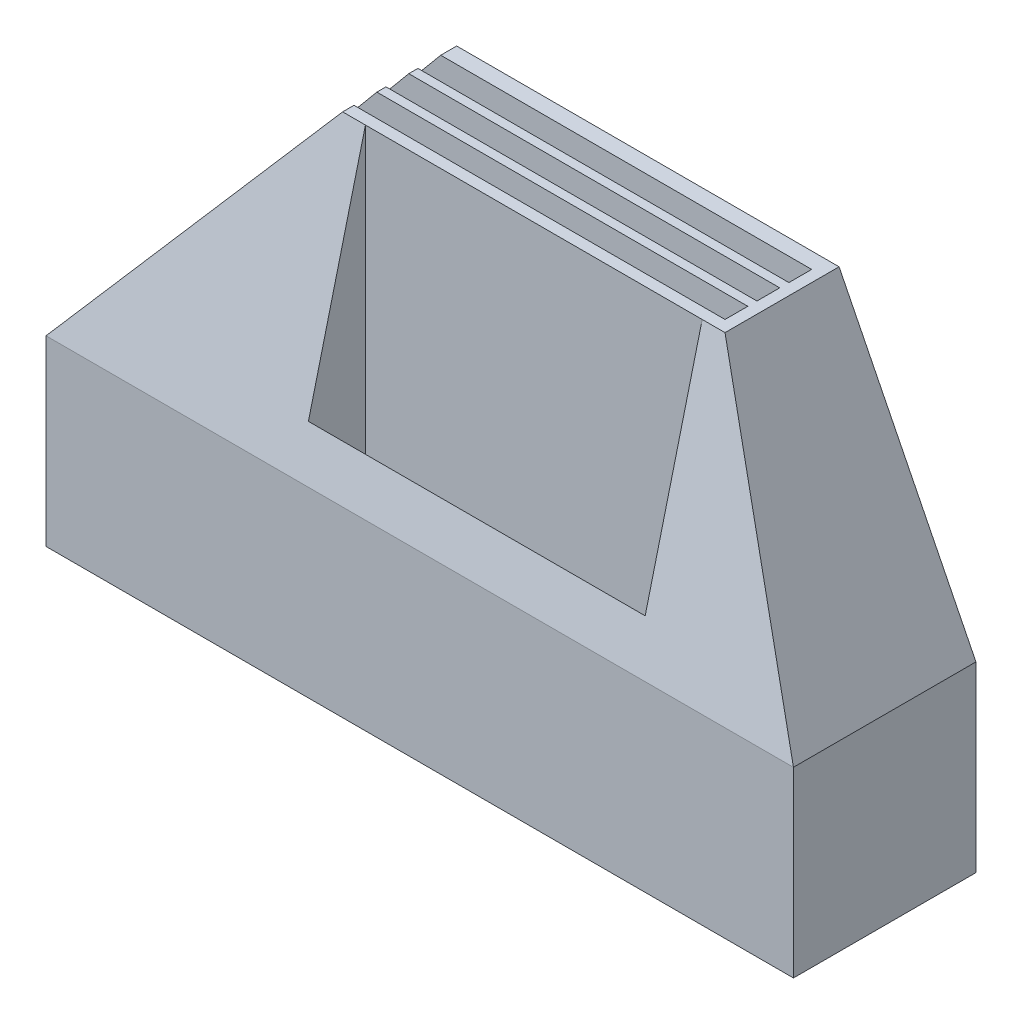
ISO-10303-21;
HEADER;
FILE_DESCRIPTION(('STEP AP214'),'2;1');
FILE_NAME('part.step','',(''),(''),'','','');
FILE_SCHEMA(('AUTOMOTIVE_DESIGN { 1 0 10303 214 1 1 1 1 }'));
ENDSEC;
DATA;
#1=APPLICATION_CONTEXT('core data for automotive mechanical design processes');
#2=APPLICATION_PROTOCOL_DEFINITION('international standard','automotive_design',2000,#1);
#3=PRODUCT_CONTEXT('',#1,'mechanical');
#4=PRODUCT('Part','Part','',(#3));
#5=PRODUCT_RELATED_PRODUCT_CATEGORY('part','',(#4));
#6=PRODUCT_DEFINITION_FORMATION('','',#4);
#7=PRODUCT_DEFINITION_CONTEXT('part definition',#1,'design');
#8=PRODUCT_DEFINITION('design','',#6,#7);
#9=PRODUCT_DEFINITION_SHAPE('','',#8);
#10=(LENGTH_UNIT() NAMED_UNIT(*) SI_UNIT(.MILLI.,.METRE.));
#11=(NAMED_UNIT(*) PLANE_ANGLE_UNIT() SI_UNIT($,.RADIAN.));
#12=(NAMED_UNIT(*) SI_UNIT($,.STERADIAN.) SOLID_ANGLE_UNIT());
#13=UNCERTAINTY_MEASURE_WITH_UNIT(LENGTH_MEASURE(1.E-05),#10,'distance_accuracy_value','');
#14=(GEOMETRIC_REPRESENTATION_CONTEXT(3) GLOBAL_UNCERTAINTY_ASSIGNED_CONTEXT((#13)) GLOBAL_UNIT_ASSIGNED_CONTEXT((#10,
#11,#12)) REPRESENTATION_CONTEXT('',''));
#15=CARTESIAN_POINT('',(0.,0.,0.));
#16=DIRECTION('',(0.,0.,1.));
#17=DIRECTION('',(1.,0.,0.));
#18=AXIS2_PLACEMENT_3D('',#15,#16,#17);
#19=CARTESIAN_POINT('',(0.,254.,0.));
#20=DIRECTION('',(0.,-1.,0.));
#21=DIRECTION('',(0.,0.,-1.));
#22=AXIS2_PLACEMENT_3D('',#19,#20,#21);
#23=PLANE('',#22);
#24=DIRECTION('',(0.,0.,1.));
#25=VECTOR('',#24,1.);
#26=CARTESIAN_POINT('',(127.,254.,-101.6));
#27=LINE('',#26,#25);
#28=CARTESIAN_POINT('',(127.,254.,-44.45));
#29=VERTEX_POINT('',#28);
#30=CARTESIAN_POINT('',(127.,254.,-38.1));
#31=VERTEX_POINT('',#30);
#32=EDGE_CURVE('E399',#29,#31,#27,.T.);
#33=ORIENTED_EDGE('',*,*,#32,.T.);
#34=DIRECTION('',(1.,0.,0.));
#35=VECTOR('',#34,1.);
#36=CARTESIAN_POINT('',(-1.11022302462516E-13,254.,-38.1));
#37=LINE('',#36,#35);
#38=CARTESIAN_POINT('',(139.7,254.,-38.1));
#39=VERTEX_POINT('',#38);
#40=EDGE_CURVE('E271',#31,#39,#37,.T.);
#41=ORIENTED_EDGE('',*,*,#40,.T.);
#42=DIRECTION('',(-1.,0.,0.));
#43=VECTOR('',#42,1.);
#44=CARTESIAN_POINT('',(139.7,254.,-38.1));
#45=LINE('',#44,#43);
#46=CARTESIAN_POINT('',(327.18,254.,-38.1));
#47=VERTEX_POINT('',#46);
#48=EDGE_CURVE('E372',#47,#39,#45,.T.);
#49=ORIENTED_EDGE('',*,*,#48,.F.);
#50=CARTESIAN_POINT('',(339.88,254.,-38.1));
#51=VERTEX_POINT('',#50);
#52=EDGE_CURVE('E268',#47,#51,#37,.T.);
#53=ORIENTED_EDGE('',*,*,#52,.T.);
#54=DIRECTION('',(0.,0.,1.));
#55=VECTOR('',#54,1.);
#56=CARTESIAN_POINT('',(339.88,254.,-101.6));
#57=LINE('',#56,#55);
#58=CARTESIAN_POINT('',(339.88,254.,-101.6));
#59=VERTEX_POINT('',#58);
#60=EDGE_CURVE('E409',#59,#51,#57,.T.);
#61=ORIENTED_EDGE('',*,*,#60,.F.);
#62=DIRECTION('',(-1.,0.,0.));
#63=VECTOR('',#62,1.);
#64=CARTESIAN_POINT('',(-1.38777878078145E-13,254.,-101.6));
#65=LINE('',#64,#63);
#66=CARTESIAN_POINT('',(127.,254.,-101.6));
#67=VERTEX_POINT('',#66);
#68=EDGE_CURVE('E416',#59,#67,#65,.T.);
#69=ORIENTED_EDGE('',*,*,#68,.T.);
#70=CARTESIAN_POINT('',(127.,254.,-92.71));
#71=VERTEX_POINT('',#70);
#72=EDGE_CURVE('E405',#67,#71,#27,.T.);
#73=ORIENTED_EDGE('',*,*,#72,.T.);
#74=DIRECTION('',(-1.,0.,0.));
#75=VECTOR('',#74,1.);
#76=CARTESIAN_POINT('',(6.34999999999974,254.,-92.71));
#77=LINE('',#76,#75);
#78=CARTESIAN_POINT('',(333.53,254.,-92.71));
#79=VERTEX_POINT('',#78);
#80=EDGE_CURVE('E327',#79,#71,#77,.T.);
#81=ORIENTED_EDGE('',*,*,#80,.F.);
#82=DIRECTION('',(0.,0.,-1.));
#83=VECTOR('',#82,1.);
#84=CARTESIAN_POINT('',(333.53,254.,-80.01));
#85=LINE('',#84,#83);
#86=CARTESIAN_POINT('',(333.53,254.,-80.01));
#87=VERTEX_POINT('',#86);
#88=EDGE_CURVE('E355',#87,#79,#85,.T.);
#89=ORIENTED_EDGE('',*,*,#88,.F.);
#90=DIRECTION('',(1.,0.,0.));
#91=VECTOR('',#90,1.);
#92=CARTESIAN_POINT('',(6.34999999999974,254.,-80.01));
#93=LINE('',#92,#91);
#94=CARTESIAN_POINT('',(127.,254.,-80.01));
#95=VERTEX_POINT('',#94);
#96=EDGE_CURVE('E358',#95,#87,#93,.T.);
#97=ORIENTED_EDGE('',*,*,#96,.F.);
#98=CARTESIAN_POINT('',(127.,254.,-74.93));
#99=VERTEX_POINT('',#98);
#100=EDGE_CURVE('E408',#95,#99,#27,.T.);
#101=ORIENTED_EDGE('',*,*,#100,.T.);
#102=DIRECTION('',(-1.,0.,0.));
#103=VECTOR('',#102,1.);
#104=CARTESIAN_POINT('',(6.3499999999998,254.,-74.93));
#105=LINE('',#104,#103);
#106=CARTESIAN_POINT('',(333.53,254.,-74.93));
#107=VERTEX_POINT('',#106);
#108=EDGE_CURVE('E302',#107,#99,#105,.T.);
#109=ORIENTED_EDGE('',*,*,#108,.F.);
#110=DIRECTION('',(0.,0.,-1.));
#111=VECTOR('',#110,1.);
#112=CARTESIAN_POINT('',(333.53,254.,-62.23));
#113=LINE('',#112,#111);
#114=CARTESIAN_POINT('',(333.53,254.,-62.23));
#115=VERTEX_POINT('',#114);
#116=EDGE_CURVE('E328',#115,#107,#113,.T.);
#117=ORIENTED_EDGE('',*,*,#116,.F.);
#118=DIRECTION('',(1.,0.,0.));
#119=VECTOR('',#118,1.);
#120=CARTESIAN_POINT('',(6.3499999999998,254.,-62.23));
#121=LINE('',#120,#119);
#122=CARTESIAN_POINT('',(127.,254.,-62.23));
#123=VERTEX_POINT('',#122);
#124=EDGE_CURVE('E331',#123,#115,#121,.T.);
#125=ORIENTED_EDGE('',*,*,#124,.F.);
#126=CARTESIAN_POINT('',(127.,254.,-57.15));
#127=VERTEX_POINT('',#126);
#128=EDGE_CURVE('E487',#123,#127,#27,.T.);
#129=ORIENTED_EDGE('',*,*,#128,.T.);
#130=DIRECTION('',(-1.,0.,0.));
#131=VECTOR('',#130,1.);
#132=CARTESIAN_POINT('',(6.34999999999986,254.,-57.15));
#133=LINE('',#132,#131);
#134=CARTESIAN_POINT('',(333.53,254.,-57.15));
#135=VERTEX_POINT('',#134);
#136=EDGE_CURVE('E301',#135,#127,#133,.T.);
#137=ORIENTED_EDGE('',*,*,#136,.F.);
#138=DIRECTION('',(0.,0.,-1.));
#139=VECTOR('',#138,1.);
#140=CARTESIAN_POINT('',(333.53,254.,-44.45));
#141=LINE('',#140,#139);
#142=CARTESIAN_POINT('',(333.53,254.,-44.45));
#143=VERTEX_POINT('',#142);
#144=EDGE_CURVE('E298',#143,#135,#141,.T.);
#145=ORIENTED_EDGE('',*,*,#144,.F.);
#146=DIRECTION('',(1.,0.,0.));
#147=VECTOR('',#146,1.);
#148=CARTESIAN_POINT('',(6.34999999999986,254.,-44.45));
#149=LINE('',#148,#147);
#150=EDGE_CURVE('E288',#29,#143,#149,.T.);
#151=ORIENTED_EDGE('',*,*,#150,.F.);
#152=EDGE_LOOP('',(#33,#41,#49,#53,#61,#69,#73,#81,#89,#97,#101,#109,#117,#125,#129,#137,#145,#151));
#153=FACE_BOUND('',#152,.T.);
#154=ADVANCED_FACE('F41',(#153),#23,.F.);
#155=CARTESIAN_POINT('',(0.,254.,0.));
#156=DIRECTION('',(1.,0.,0.));
#157=DIRECTION('',(0.,0.,-1.));
#158=AXIS2_PLACEMENT_3D('',#155,#156,#157);
#159=PLANE('',#158);
#160=DIRECTION('',(0.,-1.,0.));
#161=VECTOR('',#160,1.);
#162=CARTESIAN_POINT('',(0.,254.,0.));
#163=LINE('',#162,#161);
#164=CARTESIAN_POINT('',(-1.11022302462516E-13,101.6,0.));
#165=VERTEX_POINT('',#164);
#166=CARTESIAN_POINT('',(0.,0.,0.));
#167=VERTEX_POINT('',#166);
#168=EDGE_CURVE('E436',#165,#167,#163,.T.);
#169=ORIENTED_EDGE('',*,*,#168,.F.);
#170=DIRECTION('',(0.,0.,1.));
#171=VECTOR('',#170,1.);
#172=CARTESIAN_POINT('',(0.,101.6,-101.6));
#173=LINE('',#172,#171);
#174=CARTESIAN_POINT('',(0.,101.6,-101.6));
#175=VERTEX_POINT('',#174);
#176=EDGE_CURVE('E401',#175,#165,#173,.T.);
#177=ORIENTED_EDGE('',*,*,#176,.F.);
#178=DIRECTION('',(0.,-1.,0.));
#179=VECTOR('',#178,1.);
#180=CARTESIAN_POINT('',(-1.38777878078145E-13,254.,-101.6));
#181=LINE('',#180,#179);
#182=CARTESIAN_POINT('',(-1.38777878078145E-13,0.,-101.6));
#183=VERTEX_POINT('',#182);
#184=EDGE_CURVE('E419',#175,#183,#181,.T.);
#185=ORIENTED_EDGE('',*,*,#184,.T.);
#186=DIRECTION('',(0.,0.,1.));
#187=VECTOR('',#186,1.);
#188=CARTESIAN_POINT('',(0.,0.,0.));
#189=LINE('',#188,#187);
#190=EDGE_CURVE('E404',#183,#167,#189,.T.);
#191=ORIENTED_EDGE('',*,*,#190,.T.);
#192=EDGE_LOOP('',(#169,#177,#185,#191));
#193=FACE_BOUND('',#192,.T.);
#194=ADVANCED_FACE('F43',(#193),#159,.F.);
#195=CARTESIAN_POINT('',(0.,254.,0.));
#196=DIRECTION('',(0.,0.,-1.));
#197=DIRECTION('',(-1.,0.,0.));
#198=AXIS2_PLACEMENT_3D('',#195,#196,#197);
#199=PLANE('',#198);
#200=DIRECTION('',(0.,-1.,0.));
#201=VECTOR('',#200,1.);
#202=CARTESIAN_POINT('',(416.08,254.,1.66533453693773E-13));
#203=LINE('',#202,#201);
#204=CARTESIAN_POINT('',(416.08,101.6,0.));
#205=VERTEX_POINT('',#204);
#206=CARTESIAN_POINT('',(416.08,0.,1.66533453693773E-13));
#207=VERTEX_POINT('',#206);
#208=EDGE_CURVE('E434',#205,#207,#203,.T.);
#209=ORIENTED_EDGE('',*,*,#208,.F.);
#210=DIRECTION('',(1.,0.,0.));
#211=VECTOR('',#210,1.);
#212=CARTESIAN_POINT('',(-1.11022302462516E-13,101.6,0.));
#213=LINE('',#212,#211);
#214=EDGE_CURVE('E245',#165,#205,#213,.T.);
#215=ORIENTED_EDGE('',*,*,#214,.F.);
#216=ORIENTED_EDGE('',*,*,#168,.T.);
#217=DIRECTION('',(1.,0.,0.));
#218=VECTOR('',#217,1.);
#219=CARTESIAN_POINT('',(0.,0.,0.));
#220=LINE('',#219,#218);
#221=EDGE_CURVE('E423',#167,#207,#220,.T.);
#222=ORIENTED_EDGE('',*,*,#221,.T.);
#223=EDGE_LOOP('',(#209,#215,#216,#222));
#224=FACE_BOUND('',#223,.T.);
#225=ADVANCED_FACE('F525',(#224),#199,.F.);
#226=CARTESIAN_POINT('',(416.08,254.,1.66533453693773E-13));
#227=DIRECTION('',(-1.,0.,0.));
#228=DIRECTION('',(0.,0.,1.));
#229=AXIS2_PLACEMENT_3D('',#226,#227,#228);
#230=PLANE('',#229);
#231=DIRECTION('',(0.,-1.,0.));
#232=VECTOR('',#231,1.);
#233=CARTESIAN_POINT('',(416.08,254.,-101.6));
#234=LINE('',#233,#232);
#235=CARTESIAN_POINT('',(416.08,101.6,-101.6));
#236=VERTEX_POINT('',#235);
#237=CARTESIAN_POINT('',(416.08,0.,-101.6));
#238=VERTEX_POINT('',#237);
#239=EDGE_CURVE('E432',#236,#238,#234,.T.);
#240=ORIENTED_EDGE('',*,*,#239,.F.);
#241=DIRECTION('',(0.,0.,1.));
#242=VECTOR('',#241,1.);
#243=CARTESIAN_POINT('',(416.08,101.6,-101.6));
#244=LINE('',#243,#242);
#245=EDGE_CURVE('E395',#236,#205,#244,.T.);
#246=ORIENTED_EDGE('',*,*,#245,.T.);
#247=ORIENTED_EDGE('',*,*,#208,.T.);
#248=DIRECTION('',(0.,0.,-1.));
#249=VECTOR('',#248,1.);
#250=CARTESIAN_POINT('',(416.08,0.,1.66533453693773E-13));
#251=LINE('',#250,#249);
#252=EDGE_CURVE('E426',#207,#238,#251,.T.);
#253=ORIENTED_EDGE('',*,*,#252,.T.);
#254=EDGE_LOOP('',(#240,#246,#247,#253));
#255=FACE_BOUND('',#254,.T.);
#256=ADVANCED_FACE('F537',(#255),#230,.F.);
#257=CARTESIAN_POINT('',(-1.38777878078145E-13,254.,-101.6));
#258=DIRECTION('',(0.,0.,1.));
#259=DIRECTION('',(1.,0.,0.));
#260=AXIS2_PLACEMENT_3D('',#257,#258,#259);
#261=PLANE('',#260);
#262=DIRECTION('',(-1.,0.,0.));
#263=VECTOR('',#262,1.);
#264=CARTESIAN_POINT('',(314.48,10.4540584538938,-101.6));
#265=LINE('',#264,#263);
#266=CARTESIAN_POINT('',(314.48,10.4540584538938,-101.6));
#267=VERTEX_POINT('',#266);
#268=CARTESIAN_POINT('',(152.4,10.4540584538938,-101.6));
#269=VERTEX_POINT('',#268);
#270=EDGE_CURVE('E251',#267,#269,#265,.T.);
#271=ORIENTED_EDGE('',*,*,#270,.F.);
#272=DIRECTION('',(0.,-1.,0.));
#273=VECTOR('',#272,1.);
#274=CARTESIAN_POINT('',(314.48,10.4540584538938,-101.6));
#275=LINE('',#274,#273);
#276=CARTESIAN_POINT('',(314.48,23.6587076548535,-101.6));
#277=VERTEX_POINT('',#276);
#278=EDGE_CURVE('E233',#277,#267,#275,.T.);
#279=ORIENTED_EDGE('',*,*,#278,.F.);
#280=DIRECTION('',(1.,0.,0.));
#281=VECTOR('',#280,1.);
#282=CARTESIAN_POINT('',(314.48,23.6587076548535,-101.6));
#283=LINE('',#282,#281);
#284=CARTESIAN_POINT('',(152.4,23.6587076548535,-101.6));
#285=VERTEX_POINT('',#284);
#286=EDGE_CURVE('E242',#285,#277,#283,.T.);
#287=ORIENTED_EDGE('',*,*,#286,.F.);
#288=DIRECTION('',(0.,1.,0.));
#289=VECTOR('',#288,1.);
#290=CARTESIAN_POINT('',(152.4,10.4540584538938,-101.6));
#291=LINE('',#290,#289);
#292=EDGE_CURVE('E56',#269,#285,#291,.T.);
#293=ORIENTED_EDGE('',*,*,#292,.F.);
#294=EDGE_LOOP('',(#271,#279,#287,#293));
#295=FACE_BOUND('',#294,.T.);
#296=ORIENTED_EDGE('',*,*,#184,.F.);
#297=DIRECTION('',(0.64018439966448,0.768221279597376,0.));
#298=VECTOR('',#297,1.);
#299=CARTESIAN_POINT('',(127.,254.,-101.6));
#300=LINE('',#299,#298);
#301=EDGE_CURVE('E396',#175,#67,#300,.T.);
#302=ORIENTED_EDGE('',*,*,#301,.T.);
#303=ORIENTED_EDGE('',*,*,#68,.F.);
#304=DIRECTION('',(0.447213595499958,-0.894427190999916,0.));
#305=VECTOR('',#304,1.);
#306=CARTESIAN_POINT('',(416.08,101.6,-101.6));
#307=LINE('',#306,#305);
#308=EDGE_CURVE('E400',#59,#236,#307,.T.);
#309=ORIENTED_EDGE('',*,*,#308,.T.);
#310=ORIENTED_EDGE('',*,*,#239,.T.);
#311=DIRECTION('',(-1.,0.,0.));
#312=VECTOR('',#311,1.);
#313=CARTESIAN_POINT('',(-1.38777878078145E-13,0.,-101.6));
#314=LINE('',#313,#312);
#315=EDGE_CURVE('E420',#238,#183,#314,.T.);
#316=ORIENTED_EDGE('',*,*,#315,.T.);
#317=EDGE_LOOP('',(#296,#302,#303,#309,#310,#316));
#318=FACE_BOUND('',#317,.T.);
#319=ADVANCED_FACE('F248',(#295,#318),#261,.F.);
#320=CARTESIAN_POINT('',(0.,0.,0.));
#321=DIRECTION('',(0.,-1.,0.));
#322=DIRECTION('',(0.,0.,-1.));
#323=AXIS2_PLACEMENT_3D('',#320,#321,#322);
#324=PLANE('',#323);
#325=ORIENTED_EDGE('',*,*,#190,.F.);
#326=ORIENTED_EDGE('',*,*,#315,.F.);
#327=ORIENTED_EDGE('',*,*,#252,.F.);
#328=ORIENTED_EDGE('',*,*,#221,.F.);
#329=EDGE_LOOP('',(#325,#326,#327,#328));
#330=FACE_BOUND('',#329,.T.);
#331=ADVANCED_FACE('F531',(#330),#324,.T.);
#332=CARTESIAN_POINT('',(416.08,101.6,-101.6));
#333=DIRECTION('',(-0.894427190999916,-0.447213595499958,0.));
#334=DIRECTION('',(0.447213595499958,-0.894427190999916,0.));
#335=AXIS2_PLACEMENT_3D('',#332,#333,#334);
#336=PLANE('',#335);
#337=ORIENTED_EDGE('',*,*,#60,.T.);
#338=DIRECTION('',(0.436435780471985,-0.872871560943969,0.218217890235992));
#339=VECTOR('',#338,1.);
#340=CARTESIAN_POINT('',(406.40380952381,120.952380952381,-4.83809523809525));
#341=LINE('',#340,#339);
#342=EDGE_CURVE('E280',#51,#205,#341,.T.);
#343=ORIENTED_EDGE('',*,*,#342,.T.);
#344=ORIENTED_EDGE('',*,*,#245,.F.);
#345=ORIENTED_EDGE('',*,*,#308,.F.);
#346=EDGE_LOOP('',(#337,#343,#344,#345));
#347=FACE_BOUND('',#346,.T.);
#348=ADVANCED_FACE('F529',(#347),#336,.F.);
#349=CARTESIAN_POINT('',(127.,254.,-101.6));
#350=DIRECTION('',(0.768221279597376,-0.64018439966448,0.));
#351=DIRECTION('',(0.64018439966448,0.768221279597376,0.));
#352=AXIS2_PLACEMENT_3D('',#349,#350,#351);
#353=PLANE('',#352);
#354=ORIENTED_EDGE('',*,*,#176,.T.);
#355=DIRECTION('',(0.628694613461931,0.754433536154318,-0.188608384038579));
#356=VECTOR('',#355,1.);
#357=CARTESIAN_POINT('',(134.529644268775,263.03557312253,-40.3588932806324));
#358=LINE('',#357,#356);
#359=EDGE_CURVE('E277',#165,#31,#358,.T.);
#360=ORIENTED_EDGE('',*,*,#359,.T.);
#361=ORIENTED_EDGE('',*,*,#32,.F.);
#362=DIRECTION('',(-0.64018439966448,-0.768221279597376,0.));
#363=VECTOR('',#362,1.);
#364=CARTESIAN_POINT('',(127.,254.,-44.45));
#365=LINE('',#364,#363);
#366=CARTESIAN_POINT('',(6.34999999999986,109.22,-44.45));
#367=VERTEX_POINT('',#366);
#368=EDGE_CURVE('E49',#29,#367,#365,.T.);
#369=ORIENTED_EDGE('',*,*,#368,.T.);
#370=DIRECTION('',(0.,0.,-1.));
#371=VECTOR('',#370,1.);
#372=CARTESIAN_POINT('',(6.34999999999986,109.22,-101.6));
#373=LINE('',#372,#371);
#374=CARTESIAN_POINT('',(6.3499999999998,109.22,-57.15));
#375=VERTEX_POINT('',#374);
#376=EDGE_CURVE('E459',#367,#375,#373,.T.);
#377=ORIENTED_EDGE('',*,*,#376,.T.);
#378=DIRECTION('',(0.64018439966448,0.768221279597376,0.));
#379=VECTOR('',#378,1.);
#380=CARTESIAN_POINT('',(127.,254.,-57.15));
#381=LINE('',#380,#379);
#382=EDGE_CURVE('E456',#375,#127,#381,.T.);
#383=ORIENTED_EDGE('',*,*,#382,.T.);
#384=ORIENTED_EDGE('',*,*,#128,.F.);
#385=DIRECTION('',(-0.64018439966448,-0.768221279597376,0.));
#386=VECTOR('',#385,1.);
#387=CARTESIAN_POINT('',(127.,254.,-62.23));
#388=LINE('',#387,#386);
#389=CARTESIAN_POINT('',(6.3499999999998,109.22,-62.23));
#390=VERTEX_POINT('',#389);
#391=EDGE_CURVE('E450',#123,#390,#388,.T.);
#392=ORIENTED_EDGE('',*,*,#391,.T.);
#393=DIRECTION('',(0.,0.,-1.));
#394=VECTOR('',#393,1.);
#395=CARTESIAN_POINT('',(6.3499999999998,109.22,-101.6));
#396=LINE('',#395,#394);
#397=CARTESIAN_POINT('',(6.3499999999998,109.22,-74.93));
#398=VERTEX_POINT('',#397);
#399=EDGE_CURVE('E447',#390,#398,#396,.T.);
#400=ORIENTED_EDGE('',*,*,#399,.T.);
#401=DIRECTION('',(0.64018439966448,0.768221279597376,0.));
#402=VECTOR('',#401,1.);
#403=CARTESIAN_POINT('',(127.,254.,-74.93));
#404=LINE('',#403,#402);
#405=EDGE_CURVE('E453',#398,#99,#404,.T.);
#406=ORIENTED_EDGE('',*,*,#405,.T.);
#407=ORIENTED_EDGE('',*,*,#100,.F.);
#408=DIRECTION('',(-0.64018439966448,-0.768221279597376,0.));
#409=VECTOR('',#408,1.);
#410=CARTESIAN_POINT('',(127.,254.,-80.01));
#411=LINE('',#410,#409);
#412=CARTESIAN_POINT('',(6.34999999999974,109.22,-80.01));
#413=VERTEX_POINT('',#412);
#414=EDGE_CURVE('E441',#95,#413,#411,.T.);
#415=ORIENTED_EDGE('',*,*,#414,.T.);
#416=DIRECTION('',(0.,0.,-1.));
#417=VECTOR('',#416,1.);
#418=CARTESIAN_POINT('',(6.34999999999974,109.22,-101.6));
#419=LINE('',#418,#417);
#420=CARTESIAN_POINT('',(6.34999999999974,109.22,-92.71));
#421=VERTEX_POINT('',#420);
#422=EDGE_CURVE('E438',#413,#421,#419,.T.);
#423=ORIENTED_EDGE('',*,*,#422,.T.);
#424=DIRECTION('',(0.64018439966448,0.768221279597376,0.));
#425=VECTOR('',#424,1.);
#426=CARTESIAN_POINT('',(127.,254.,-92.71));
#427=LINE('',#426,#425);
#428=EDGE_CURVE('E444',#421,#71,#427,.T.);
#429=ORIENTED_EDGE('',*,*,#428,.T.);
#430=ORIENTED_EDGE('',*,*,#72,.F.);
#431=ORIENTED_EDGE('',*,*,#301,.F.);
#432=EDGE_LOOP('',(#354,#360,#361,#369,#377,#383,#384,#392,#400,#406,#407,#415,#423,#429,#430,#431));
#433=FACE_BOUND('',#432,.T.);
#434=ADVANCED_FACE('F464',(#433),#353,.F.);
#435=CARTESIAN_POINT('',(327.18,254.,-38.1));
#436=DIRECTION('',(-1.,0.,0.));
#437=DIRECTION('',(0.,0.,1.));
#438=AXIS2_PLACEMENT_3D('',#435,#436,#437);
#439=PLANE('',#438);
#440=DIRECTION('',(0.,-0.970142500145332,0.242535625036333));
#441=VECTOR('',#440,1.);
#442=CARTESIAN_POINT('',(327.18,254.,-38.1));
#443=LINE('',#442,#441);
#444=CARTESIAN_POINT('',(327.18,127.,-6.34999999999998));
#445=VERTEX_POINT('',#444);
#446=EDGE_CURVE('E275',#47,#445,#443,.T.);
#447=ORIENTED_EDGE('',*,*,#446,.F.);
#448=DIRECTION('',(0.,-1.,0.));
#449=VECTOR('',#448,1.);
#450=CARTESIAN_POINT('',(327.18,254.,-38.1));
#451=LINE('',#450,#449);
#452=CARTESIAN_POINT('',(327.18,10.16,-38.1));
#453=VERTEX_POINT('',#452);
#454=EDGE_CURVE('E392',#47,#453,#451,.T.);
#455=ORIENTED_EDGE('',*,*,#454,.T.);
#456=DIRECTION('',(0.,0.,-1.));
#457=VECTOR('',#456,1.);
#458=CARTESIAN_POINT('',(327.18,10.16,-38.1));
#459=LINE('',#458,#457);
#460=CARTESIAN_POINT('',(327.18,10.16,-6.34999999999998));
#461=VERTEX_POINT('',#460);
#462=EDGE_CURVE('E308',#461,#453,#459,.T.);
#463=ORIENTED_EDGE('',*,*,#462,.F.);
#464=DIRECTION('',(0.,-1.,0.));
#465=VECTOR('',#464,1.);
#466=CARTESIAN_POINT('',(327.18,254.,-6.34999999999998));
#467=LINE('',#466,#465);
#468=EDGE_CURVE('E375',#445,#461,#467,.T.);
#469=ORIENTED_EDGE('',*,*,#468,.F.);
#470=EDGE_LOOP('',(#447,#455,#463,#469));
#471=FACE_BOUND('',#470,.T.);
#472=ADVANCED_FACE('F563',(#471),#439,.T.);
#473=CARTESIAN_POINT('',(139.7,254.,-38.1));
#474=DIRECTION('',(0.,0.,1.));
#475=DIRECTION('',(1.,0.,0.));
#476=AXIS2_PLACEMENT_3D('',#473,#474,#475);
#477=PLANE('',#476);
#478=DIRECTION('',(0.,1.,0.));
#479=VECTOR('',#478,1.);
#480=CARTESIAN_POINT('',(314.48,10.4540584538938,-38.1));
#481=LINE('',#480,#479);
#482=CARTESIAN_POINT('',(314.48,10.4540584538938,-38.1));
#483=VERTEX_POINT('',#482);
#484=CARTESIAN_POINT('',(314.48,23.6587076548535,-38.1));
#485=VERTEX_POINT('',#484);
#486=EDGE_CURVE('E64',#483,#485,#481,.T.);
#487=ORIENTED_EDGE('',*,*,#486,.F.);
#488=DIRECTION('',(1.,0.,0.));
#489=VECTOR('',#488,1.);
#490=CARTESIAN_POINT('',(314.48,10.4540584538938,-38.1));
#491=LINE('',#490,#489);
#492=CARTESIAN_POINT('',(152.4,10.4540584538938,-38.1));
#493=VERTEX_POINT('',#492);
#494=EDGE_CURVE('E239',#493,#483,#491,.T.);
#495=ORIENTED_EDGE('',*,*,#494,.F.);
#496=DIRECTION('',(0.,-1.,0.));
#497=VECTOR('',#496,1.);
#498=CARTESIAN_POINT('',(152.4,10.4540584538938,-38.1));
#499=LINE('',#498,#497);
#500=CARTESIAN_POINT('',(152.4,23.6587076548535,-38.1));
#501=VERTEX_POINT('',#500);
#502=EDGE_CURVE('E259',#501,#493,#499,.T.);
#503=ORIENTED_EDGE('',*,*,#502,.F.);
#504=DIRECTION('',(-1.,0.,0.));
#505=VECTOR('',#504,1.);
#506=CARTESIAN_POINT('',(314.48,23.6587076548535,-38.1));
#507=LINE('',#506,#505);
#508=EDGE_CURVE('E253',#485,#501,#507,.T.);
#509=ORIENTED_EDGE('',*,*,#508,.F.);
#510=EDGE_LOOP('',(#487,#495,#503,#509));
#511=FACE_BOUND('',#510,.T.);
#512=DIRECTION('',(-1.,0.,0.));
#513=VECTOR('',#512,1.);
#514=CARTESIAN_POINT('',(139.7,10.16,-38.1));
#515=LINE('',#514,#513);
#516=CARTESIAN_POINT('',(139.7,10.16,-38.1));
#517=VERTEX_POINT('',#516);
#518=EDGE_CURVE('E379',#453,#517,#515,.T.);
#519=ORIENTED_EDGE('',*,*,#518,.F.);
#520=ORIENTED_EDGE('',*,*,#454,.F.);
#521=ORIENTED_EDGE('',*,*,#48,.T.);
#522=DIRECTION('',(0.,-1.,0.));
#523=VECTOR('',#522,1.);
#524=CARTESIAN_POINT('',(139.7,254.,-38.1));
#525=LINE('',#524,#523);
#526=EDGE_CURVE('E389',#39,#517,#525,.T.);
#527=ORIENTED_EDGE('',*,*,#526,.T.);
#528=EDGE_LOOP('',(#519,#520,#521,#527));
#529=FACE_BOUND('',#528,.T.);
#530=ADVANCED_FACE('F566',(#511,#529),#477,.T.);
#531=CARTESIAN_POINT('',(139.7,254.,-38.1));
#532=DIRECTION('',(1.,0.,0.));
#533=DIRECTION('',(0.,0.,-1.));
#534=AXIS2_PLACEMENT_3D('',#531,#532,#533);
#535=PLANE('',#534);
#536=DIRECTION('',(0.,0.970142500145332,-0.242535625036333));
#537=VECTOR('',#536,1.);
#538=CARTESIAN_POINT('',(139.7,254.,-38.1));
#539=LINE('',#538,#537);
#540=CARTESIAN_POINT('',(139.7,127.,-6.35));
#541=VERTEX_POINT('',#540);
#542=EDGE_CURVE('E273',#541,#39,#539,.T.);
#543=ORIENTED_EDGE('',*,*,#542,.F.);
#544=DIRECTION('',(0.,-1.,0.));
#545=VECTOR('',#544,1.);
#546=CARTESIAN_POINT('',(139.7,254.,-6.35));
#547=LINE('',#546,#545);
#548=CARTESIAN_POINT('',(139.7,10.16,-6.35));
#549=VERTEX_POINT('',#548);
#550=EDGE_CURVE('E387',#541,#549,#547,.T.);
#551=ORIENTED_EDGE('',*,*,#550,.T.);
#552=DIRECTION('',(0.,0.,1.));
#553=VECTOR('',#552,1.);
#554=CARTESIAN_POINT('',(139.7,10.16,-38.1));
#555=LINE('',#554,#553);
#556=EDGE_CURVE('E381',#517,#549,#555,.T.);
#557=ORIENTED_EDGE('',*,*,#556,.F.);
#558=ORIENTED_EDGE('',*,*,#526,.F.);
#559=EDGE_LOOP('',(#543,#551,#557,#558));
#560=FACE_BOUND('',#559,.T.);
#561=ADVANCED_FACE('F577',(#560),#535,.T.);
#562=CARTESIAN_POINT('',(139.7,254.,-6.35));
#563=DIRECTION('',(0.,0.,-1.));
#564=DIRECTION('',(-1.,0.,0.));
#565=AXIS2_PLACEMENT_3D('',#562,#563,#564);
#566=PLANE('',#565);
#567=DIRECTION('',(-1.,0.,0.));
#568=VECTOR('',#567,1.);
#569=CARTESIAN_POINT('',(139.7,127.,-6.35));
#570=LINE('',#569,#568);
#571=EDGE_CURVE('E12',#445,#541,#570,.T.);
#572=ORIENTED_EDGE('',*,*,#571,.F.);
#573=ORIENTED_EDGE('',*,*,#468,.T.);
#574=DIRECTION('',(1.,0.,0.));
#575=VECTOR('',#574,1.);
#576=CARTESIAN_POINT('',(139.7,10.16,-6.35));
#577=LINE('',#576,#575);
#578=EDGE_CURVE('E376',#549,#461,#577,.T.);
#579=ORIENTED_EDGE('',*,*,#578,.F.);
#580=ORIENTED_EDGE('',*,*,#550,.F.);
#581=EDGE_LOOP('',(#572,#573,#579,#580));
#582=FACE_BOUND('',#581,.T.);
#583=ADVANCED_FACE('F574',(#582),#566,.T.);
#584=CARTESIAN_POINT('',(0.,10.16,0.));
#585=DIRECTION('',(0.,1.,0.));
#586=DIRECTION('',(0.,0.,1.));
#587=AXIS2_PLACEMENT_3D('',#584,#585,#586);
#588=PLANE('',#587);
#589=ORIENTED_EDGE('',*,*,#462,.T.);
#590=ORIENTED_EDGE('',*,*,#518,.T.);
#591=ORIENTED_EDGE('',*,*,#556,.T.);
#592=ORIENTED_EDGE('',*,*,#578,.T.);
#593=EDGE_LOOP('',(#589,#590,#591,#592));
#594=FACE_BOUND('',#593,.T.);
#595=ADVANCED_FACE('F570',(#594),#588,.T.);
#596=CARTESIAN_POINT('',(6.34999999999974,25.4,-92.71));
#597=DIRECTION('',(0.,0.,-1.));
#598=DIRECTION('',(-1.,0.,0.));
#599=AXIS2_PLACEMENT_3D('',#596,#597,#598);
#600=PLANE('',#599);
#601=DIRECTION('',(0.,1.,0.));
#602=VECTOR('',#601,1.);
#603=CARTESIAN_POINT('',(6.34999999999974,25.4,-92.71));
#604=LINE('',#603,#602);
#605=CARTESIAN_POINT('',(6.34999999999974,25.4,-92.71));
#606=VERTEX_POINT('',#605);
#607=EDGE_CURVE('E345',#606,#421,#604,.T.);
#608=ORIENTED_EDGE('',*,*,#607,.F.);
#609=DIRECTION('',(-1.,0.,0.));
#610=VECTOR('',#609,1.);
#611=CARTESIAN_POINT('',(6.34999999999974,25.4,-92.71));
#612=LINE('',#611,#610);
#613=CARTESIAN_POINT('',(333.53,25.4,-92.71));
#614=VERTEX_POINT('',#613);
#615=EDGE_CURVE('E359',#614,#606,#612,.T.);
#616=ORIENTED_EDGE('',*,*,#615,.F.);
#617=DIRECTION('',(0.,1.,0.));
#618=VECTOR('',#617,1.);
#619=CARTESIAN_POINT('',(333.53,25.4,-92.71));
#620=LINE('',#619,#618);
#621=EDGE_CURVE('E283',#614,#79,#620,.T.);
#622=ORIENTED_EDGE('',*,*,#621,.T.);
#623=ORIENTED_EDGE('',*,*,#80,.T.);
#624=ORIENTED_EDGE('',*,*,#428,.F.);
#625=EDGE_LOOP('',(#608,#616,#622,#623,#624));
#626=FACE_BOUND('',#625,.T.);
#627=ADVANCED_FACE('F626',(#626),#600,.F.);
#628=CARTESIAN_POINT('',(6.34999999999974,25.4,-80.01));
#629=DIRECTION('',(0.,0.,1.));
#630=DIRECTION('',(1.,0.,0.));
#631=AXIS2_PLACEMENT_3D('',#628,#629,#630);
#632=PLANE('',#631);
#633=ORIENTED_EDGE('',*,*,#96,.T.);
#634=DIRECTION('',(0.,1.,0.));
#635=VECTOR('',#634,1.);
#636=CARTESIAN_POINT('',(333.53,25.4,-80.01));
#637=LINE('',#636,#635);
#638=CARTESIAN_POINT('',(333.53,25.4,-80.01));
#639=VERTEX_POINT('',#638);
#640=EDGE_CURVE('E351',#639,#87,#637,.T.);
#641=ORIENTED_EDGE('',*,*,#640,.F.);
#642=DIRECTION('',(1.,0.,0.));
#643=VECTOR('',#642,1.);
#644=CARTESIAN_POINT('',(6.34999999999974,25.4,-80.01));
#645=LINE('',#644,#643);
#646=CARTESIAN_POINT('',(6.34999999999974,25.4,-80.01));
#647=VERTEX_POINT('',#646);
#648=EDGE_CURVE('E364',#647,#639,#645,.T.);
#649=ORIENTED_EDGE('',*,*,#648,.F.);
#650=DIRECTION('',(0.,1.,0.));
#651=VECTOR('',#650,1.);
#652=CARTESIAN_POINT('',(6.34999999999974,25.4,-80.01));
#653=LINE('',#652,#651);
#654=EDGE_CURVE('E348',#647,#413,#653,.T.);
#655=ORIENTED_EDGE('',*,*,#654,.T.);
#656=ORIENTED_EDGE('',*,*,#414,.F.);
#657=EDGE_LOOP('',(#633,#641,#649,#655,#656));
#658=FACE_BOUND('',#657,.T.);
#659=ADVANCED_FACE('F634',(#658),#632,.F.);
#660=CARTESIAN_POINT('',(6.34999999999974,25.4,-80.01));
#661=DIRECTION('',(-1.,0.,0.));
#662=DIRECTION('',(0.,0.,1.));
#663=AXIS2_PLACEMENT_3D('',#660,#661,#662);
#664=PLANE('',#663);
#665=ORIENTED_EDGE('',*,*,#654,.F.);
#666=DIRECTION('',(0.,0.,1.));
#667=VECTOR('',#666,1.);
#668=CARTESIAN_POINT('',(6.34999999999974,25.4,-80.01));
#669=LINE('',#668,#667);
#670=EDGE_CURVE('E367',#606,#647,#669,.T.);
#671=ORIENTED_EDGE('',*,*,#670,.F.);
#672=ORIENTED_EDGE('',*,*,#607,.T.);
#673=ORIENTED_EDGE('',*,*,#422,.F.);
#674=EDGE_LOOP('',(#665,#671,#672,#673));
#675=FACE_BOUND('',#674,.T.);
#676=ADVANCED_FACE('F643',(#675),#664,.F.);
#677=CARTESIAN_POINT('',(333.53,25.4,-80.01));
#678=DIRECTION('',(1.,0.,0.));
#679=DIRECTION('',(0.,0.,-1.));
#680=AXIS2_PLACEMENT_3D('',#677,#678,#679);
#681=PLANE('',#680);
#682=ORIENTED_EDGE('',*,*,#88,.T.);
#683=ORIENTED_EDGE('',*,*,#621,.F.);
#684=DIRECTION('',(0.,0.,-1.));
#685=VECTOR('',#684,1.);
#686=CARTESIAN_POINT('',(333.53,25.4,-80.01));
#687=LINE('',#686,#685);
#688=EDGE_CURVE('E347',#639,#614,#687,.T.);
#689=ORIENTED_EDGE('',*,*,#688,.F.);
#690=ORIENTED_EDGE('',*,*,#640,.T.);
#691=EDGE_LOOP('',(#682,#683,#689,#690));
#692=FACE_BOUND('',#691,.T.);
#693=ADVANCED_FACE('F652',(#692),#681,.F.);
#694=CARTESIAN_POINT('',(0.,25.4,0.));
#695=DIRECTION('',(0.,1.,0.));
#696=DIRECTION('',(0.,0.,1.));
#697=AXIS2_PLACEMENT_3D('',#694,#695,#696);
#698=PLANE('',#697);
#699=ORIENTED_EDGE('',*,*,#615,.T.);
#700=ORIENTED_EDGE('',*,*,#670,.T.);
#701=ORIENTED_EDGE('',*,*,#648,.T.);
#702=ORIENTED_EDGE('',*,*,#688,.T.);
#703=EDGE_LOOP('',(#699,#700,#701,#702));
#704=FACE_BOUND('',#703,.T.);
#705=ADVANCED_FACE('F661',(#704),#698,.T.);
#706=CARTESIAN_POINT('',(6.3499999999998,25.4,-74.93));
#707=DIRECTION('',(0.,0.,-1.));
#708=DIRECTION('',(-1.,0.,0.));
#709=AXIS2_PLACEMENT_3D('',#706,#707,#708);
#710=PLANE('',#709);
#711=DIRECTION('',(0.,1.,0.));
#712=VECTOR('',#711,1.);
#713=CARTESIAN_POINT('',(6.3499999999998,25.4,-74.93));
#714=LINE('',#713,#712);
#715=CARTESIAN_POINT('',(6.3499999999998,25.4,-74.93));
#716=VERTEX_POINT('',#715);
#717=EDGE_CURVE('E316',#716,#398,#714,.T.);
#718=ORIENTED_EDGE('',*,*,#717,.F.);
#719=DIRECTION('',(-1.,0.,0.));
#720=VECTOR('',#719,1.);
#721=CARTESIAN_POINT('',(6.3499999999998,25.4,-74.93));
#722=LINE('',#721,#720);
#723=CARTESIAN_POINT('',(333.53,25.4,-74.93));
#724=VERTEX_POINT('',#723);
#725=EDGE_CURVE('E332',#724,#716,#722,.T.);
#726=ORIENTED_EDGE('',*,*,#725,.F.);
#727=DIRECTION('',(0.,1.,0.));
#728=VECTOR('',#727,1.);
#729=CARTESIAN_POINT('',(333.53,25.4,-74.93));
#730=LINE('',#729,#728);
#731=EDGE_CURVE('E325',#724,#107,#730,.T.);
#732=ORIENTED_EDGE('',*,*,#731,.T.);
#733=ORIENTED_EDGE('',*,*,#108,.T.);
#734=ORIENTED_EDGE('',*,*,#405,.F.);
#735=EDGE_LOOP('',(#718,#726,#732,#733,#734));
#736=FACE_BOUND('',#735,.T.);
#737=ADVANCED_FACE('F497',(#736),#710,.F.);
#738=CARTESIAN_POINT('',(6.3499999999998,25.4,-62.23));
#739=DIRECTION('',(0.,0.,1.));
#740=DIRECTION('',(1.,0.,0.));
#741=AXIS2_PLACEMENT_3D('',#738,#739,#740);
#742=PLANE('',#741);
#743=ORIENTED_EDGE('',*,*,#124,.T.);
#744=DIRECTION('',(0.,1.,0.));
#745=VECTOR('',#744,1.);
#746=CARTESIAN_POINT('',(333.53,25.4,-62.23));
#747=LINE('',#746,#745);
#748=CARTESIAN_POINT('',(333.53,25.4,-62.23));
#749=VERTEX_POINT('',#748);
#750=EDGE_CURVE('E322',#749,#115,#747,.T.);
#751=ORIENTED_EDGE('',*,*,#750,.F.);
#752=DIRECTION('',(1.,0.,0.));
#753=VECTOR('',#752,1.);
#754=CARTESIAN_POINT('',(6.3499999999998,25.4,-62.23));
#755=LINE('',#754,#753);
#756=CARTESIAN_POINT('',(6.3499999999998,25.4,-62.23));
#757=VERTEX_POINT('',#756);
#758=EDGE_CURVE('E337',#757,#749,#755,.T.);
#759=ORIENTED_EDGE('',*,*,#758,.F.);
#760=DIRECTION('',(0.,1.,0.));
#761=VECTOR('',#760,1.);
#762=CARTESIAN_POINT('',(6.3499999999998,25.4,-62.23));
#763=LINE('',#762,#761);
#764=EDGE_CURVE('E319',#757,#390,#763,.T.);
#765=ORIENTED_EDGE('',*,*,#764,.T.);
#766=ORIENTED_EDGE('',*,*,#391,.F.);
#767=EDGE_LOOP('',(#743,#751,#759,#765,#766));
#768=FACE_BOUND('',#767,.T.);
#769=ADVANCED_FACE('F505',(#768),#742,.F.);
#770=CARTESIAN_POINT('',(6.3499999999998,25.4,-62.23));
#771=DIRECTION('',(-1.,0.,0.));
#772=DIRECTION('',(0.,0.,1.));
#773=AXIS2_PLACEMENT_3D('',#770,#771,#772);
#774=PLANE('',#773);
#775=ORIENTED_EDGE('',*,*,#764,.F.);
#776=DIRECTION('',(0.,0.,1.));
#777=VECTOR('',#776,1.);
#778=CARTESIAN_POINT('',(6.3499999999998,25.4,-62.23));
#779=LINE('',#778,#777);
#780=EDGE_CURVE('E340',#716,#757,#779,.T.);
#781=ORIENTED_EDGE('',*,*,#780,.F.);
#782=ORIENTED_EDGE('',*,*,#717,.T.);
#783=ORIENTED_EDGE('',*,*,#399,.F.);
#784=EDGE_LOOP('',(#775,#781,#782,#783));
#785=FACE_BOUND('',#784,.T.);
#786=ADVANCED_FACE('F509',(#785),#774,.F.);
#787=CARTESIAN_POINT('',(333.53,25.4,-62.23));
#788=DIRECTION('',(1.,0.,0.));
#789=DIRECTION('',(0.,0.,-1.));
#790=AXIS2_PLACEMENT_3D('',#787,#788,#789);
#791=PLANE('',#790);
#792=ORIENTED_EDGE('',*,*,#116,.T.);
#793=ORIENTED_EDGE('',*,*,#731,.F.);
#794=DIRECTION('',(0.,0.,-1.));
#795=VECTOR('',#794,1.);
#796=CARTESIAN_POINT('',(333.53,25.4,-62.23));
#797=LINE('',#796,#795);
#798=EDGE_CURVE('E318',#749,#724,#797,.T.);
#799=ORIENTED_EDGE('',*,*,#798,.F.);
#800=ORIENTED_EDGE('',*,*,#750,.T.);
#801=EDGE_LOOP('',(#792,#793,#799,#800));
#802=FACE_BOUND('',#801,.T.);
#803=ADVANCED_FACE('F502',(#802),#791,.F.);
#804=CARTESIAN_POINT('',(0.,25.4,0.));
#805=DIRECTION('',(0.,1.,0.));
#806=DIRECTION('',(0.,0.,1.));
#807=AXIS2_PLACEMENT_3D('',#804,#805,#806);
#808=PLANE('',#807);
#809=ORIENTED_EDGE('',*,*,#725,.T.);
#810=ORIENTED_EDGE('',*,*,#780,.T.);
#811=ORIENTED_EDGE('',*,*,#758,.T.);
#812=ORIENTED_EDGE('',*,*,#798,.T.);
#813=EDGE_LOOP('',(#809,#810,#811,#812));
#814=FACE_BOUND('',#813,.T.);
#815=ADVANCED_FACE('F507',(#814),#808,.T.);
#816=CARTESIAN_POINT('',(6.34999999999986,25.4,-44.45));
#817=DIRECTION('',(0.,0.,1.));
#818=DIRECTION('',(1.,0.,0.));
#819=AXIS2_PLACEMENT_3D('',#816,#817,#818);
#820=PLANE('',#819);
#821=ORIENTED_EDGE('',*,*,#150,.T.);
#822=DIRECTION('',(0.,1.,0.));
#823=VECTOR('',#822,1.);
#824=CARTESIAN_POINT('',(333.53,25.4,-44.45));
#825=LINE('',#824,#823);
#826=CARTESIAN_POINT('',(333.53,25.4,-44.45));
#827=VERTEX_POINT('',#826);
#828=EDGE_CURVE('E305',#827,#143,#825,.T.);
#829=ORIENTED_EDGE('',*,*,#828,.F.);
#830=DIRECTION('',(1.,0.,0.));
#831=VECTOR('',#830,1.);
#832=CARTESIAN_POINT('',(6.34999999999986,25.4,-44.45));
#833=LINE('',#832,#831);
#834=CARTESIAN_POINT('',(6.34999999999986,25.4,-44.45));
#835=VERTEX_POINT('',#834);
#836=EDGE_CURVE('E294',#835,#827,#833,.T.);
#837=ORIENTED_EDGE('',*,*,#836,.F.);
#838=DIRECTION('',(0.,1.,0.));
#839=VECTOR('',#838,1.);
#840=CARTESIAN_POINT('',(6.34999999999986,25.4,-44.45));
#841=LINE('',#840,#839);
#842=EDGE_CURVE('E309',#835,#367,#841,.T.);
#843=ORIENTED_EDGE('',*,*,#842,.T.);
#844=ORIENTED_EDGE('',*,*,#368,.F.);
#845=EDGE_LOOP('',(#821,#829,#837,#843,#844));
#846=FACE_BOUND('',#845,.T.);
#847=ADVANCED_FACE('F468',(#846),#820,.F.);
#848=CARTESIAN_POINT('',(6.34999999999986,25.4,-44.45));
#849=DIRECTION('',(-1.,0.,0.));
#850=DIRECTION('',(0.,0.,1.));
#851=AXIS2_PLACEMENT_3D('',#848,#849,#850);
#852=PLANE('',#851);
#853=ORIENTED_EDGE('',*,*,#842,.F.);
#854=DIRECTION('',(0.,0.,1.));
#855=VECTOR('',#854,1.);
#856=CARTESIAN_POINT('',(6.34999999999986,25.4,-44.45));
#857=LINE('',#856,#855);
#858=CARTESIAN_POINT('',(6.34999999999986,25.4,-57.15));
#859=VERTEX_POINT('',#858);
#860=EDGE_CURVE('E291',#859,#835,#857,.T.);
#861=ORIENTED_EDGE('',*,*,#860,.F.);
#862=DIRECTION('',(0.,1.,0.));
#863=VECTOR('',#862,1.);
#864=CARTESIAN_POINT('',(6.34999999999986,25.4,-57.15));
#865=LINE('',#864,#863);
#866=EDGE_CURVE('E312',#859,#375,#865,.T.);
#867=ORIENTED_EDGE('',*,*,#866,.T.);
#868=ORIENTED_EDGE('',*,*,#376,.F.);
#869=EDGE_LOOP('',(#853,#861,#867,#868));
#870=FACE_BOUND('',#869,.T.);
#871=ADVANCED_FACE('F483',(#870),#852,.F.);
#872=CARTESIAN_POINT('',(6.34999999999986,25.4,-57.15));
#873=DIRECTION('',(0.,0.,-1.));
#874=DIRECTION('',(-1.,0.,0.));
#875=AXIS2_PLACEMENT_3D('',#872,#873,#874);
#876=PLANE('',#875);
#877=ORIENTED_EDGE('',*,*,#866,.F.);
#878=DIRECTION('',(-1.,0.,0.));
#879=VECTOR('',#878,1.);
#880=CARTESIAN_POINT('',(6.34999999999986,25.4,-57.15));
#881=LINE('',#880,#879);
#882=CARTESIAN_POINT('',(333.53,25.4,-57.15));
#883=VERTEX_POINT('',#882);
#884=EDGE_CURVE('E287',#883,#859,#881,.T.);
#885=ORIENTED_EDGE('',*,*,#884,.F.);
#886=DIRECTION('',(0.,1.,0.));
#887=VECTOR('',#886,1.);
#888=CARTESIAN_POINT('',(333.53,25.4,-57.15));
#889=LINE('',#888,#887);
#890=EDGE_CURVE('E297',#883,#135,#889,.T.);
#891=ORIENTED_EDGE('',*,*,#890,.T.);
#892=ORIENTED_EDGE('',*,*,#136,.T.);
#893=ORIENTED_EDGE('',*,*,#382,.F.);
#894=EDGE_LOOP('',(#877,#885,#891,#892,#893));
#895=FACE_BOUND('',#894,.T.);
#896=ADVANCED_FACE('F485',(#895),#876,.F.);
#897=CARTESIAN_POINT('',(333.53,25.4,-44.45));
#898=DIRECTION('',(1.,0.,0.));
#899=DIRECTION('',(0.,0.,-1.));
#900=AXIS2_PLACEMENT_3D('',#897,#898,#899);
#901=PLANE('',#900);
#902=ORIENTED_EDGE('',*,*,#144,.T.);
#903=ORIENTED_EDGE('',*,*,#890,.F.);
#904=DIRECTION('',(0.,0.,-1.));
#905=VECTOR('',#904,1.);
#906=CARTESIAN_POINT('',(333.53,25.4,-44.45));
#907=LINE('',#906,#905);
#908=EDGE_CURVE('E284',#827,#883,#907,.T.);
#909=ORIENTED_EDGE('',*,*,#908,.F.);
#910=ORIENTED_EDGE('',*,*,#828,.T.);
#911=EDGE_LOOP('',(#902,#903,#909,#910));
#912=FACE_BOUND('',#911,.T.);
#913=ADVANCED_FACE('F476',(#912),#901,.F.);
#914=CARTESIAN_POINT('',(0.,25.4,0.));
#915=DIRECTION('',(0.,-1.,0.));
#916=DIRECTION('',(0.,0.,-1.));
#917=AXIS2_PLACEMENT_3D('',#914,#915,#916);
#918=PLANE('',#917);
#919=ORIENTED_EDGE('',*,*,#908,.T.);
#920=ORIENTED_EDGE('',*,*,#884,.T.);
#921=ORIENTED_EDGE('',*,*,#860,.T.);
#922=ORIENTED_EDGE('',*,*,#836,.T.);
#923=EDGE_LOOP('',(#919,#920,#921,#922));
#924=FACE_BOUND('',#923,.T.);
#925=ADVANCED_FACE('F480',(#924),#918,.F.);
#926=CARTESIAN_POINT('',(-1.11022302462516E-13,101.6,0.));
#927=DIRECTION('',(0.,-0.242535625036333,-0.970142500145332));
#928=DIRECTION('',(0.,0.970142500145332,-0.242535625036333));
#929=AXIS2_PLACEMENT_3D('',#926,#927,#928);
#930=PLANE('',#929);
#931=ORIENTED_EDGE('',*,*,#52,.F.);
#932=ORIENTED_EDGE('',*,*,#446,.T.);
#933=ORIENTED_EDGE('',*,*,#571,.T.);
#934=ORIENTED_EDGE('',*,*,#542,.T.);
#935=ORIENTED_EDGE('',*,*,#40,.F.);
#936=ORIENTED_EDGE('',*,*,#359,.F.);
#937=ORIENTED_EDGE('',*,*,#214,.T.);
#938=ORIENTED_EDGE('',*,*,#342,.F.);
#939=EDGE_LOOP('',(#931,#932,#933,#934,#935,#936,#937,#938));
#940=FACE_BOUND('',#939,.T.);
#941=ADVANCED_FACE('F558',(#940),#930,.F.);
#942=CARTESIAN_POINT('',(314.48,10.4540584538938,-101.601));
#943=DIRECTION('',(1.,0.,0.));
#944=DIRECTION('',(0.,0.,-1.));
#945=AXIS2_PLACEMENT_3D('',#942,#943,#944);
#946=PLANE('',#945);
#947=ORIENTED_EDGE('',*,*,#278,.T.);
#948=DIRECTION('',(0.,0.,1.));
#949=VECTOR('',#948,1.);
#950=CARTESIAN_POINT('',(314.48,10.4540584538938,-101.601));
#951=LINE('',#950,#949);
#952=EDGE_CURVE('E246',#267,#483,#951,.T.);
#953=ORIENTED_EDGE('',*,*,#952,.T.);
#954=ORIENTED_EDGE('',*,*,#486,.T.);
#955=DIRECTION('',(0.,0.,1.));
#956=VECTOR('',#955,1.);
#957=CARTESIAN_POINT('',(314.48,23.6587076548535,-101.601));
#958=LINE('',#957,#956);
#959=EDGE_CURVE('E229',#277,#485,#958,.T.);
#960=ORIENTED_EDGE('',*,*,#959,.F.);
#961=EDGE_LOOP('',(#947,#953,#954,#960));
#962=FACE_BOUND('',#961,.T.);
#963=ADVANCED_FACE('F231',(#962),#946,.F.);
#964=CARTESIAN_POINT('',(314.48,10.4540584538938,-101.601));
#965=DIRECTION('',(0.,-1.,0.));
#966=DIRECTION('',(1.,0.,0.));
#967=AXIS2_PLACEMENT_3D('',#964,#965,#966);
#968=PLANE('',#967);
#969=ORIENTED_EDGE('',*,*,#270,.T.);
#970=DIRECTION('',(0.,0.,1.));
#971=VECTOR('',#970,1.);
#972=CARTESIAN_POINT('',(152.4,10.4540584538938,-101.601));
#973=LINE('',#972,#971);
#974=EDGE_CURVE('E265',#269,#493,#973,.T.);
#975=ORIENTED_EDGE('',*,*,#974,.T.);
#976=ORIENTED_EDGE('',*,*,#494,.T.);
#977=ORIENTED_EDGE('',*,*,#952,.F.);
#978=EDGE_LOOP('',(#969,#975,#976,#977));
#979=FACE_BOUND('',#978,.T.);
#980=ADVANCED_FACE('F756',(#979),#968,.F.);
#981=CARTESIAN_POINT('',(152.4,10.4540584538938,-101.601));
#982=DIRECTION('',(-1.,0.,0.));
#983=DIRECTION('',(0.,0.,1.));
#984=AXIS2_PLACEMENT_3D('',#981,#982,#983);
#985=PLANE('',#984);
#986=ORIENTED_EDGE('',*,*,#292,.T.);
#987=DIRECTION('',(0.,0.,1.));
#988=VECTOR('',#987,1.);
#989=CARTESIAN_POINT('',(152.4,23.6587076548535,-101.601));
#990=LINE('',#989,#988);
#991=EDGE_CURVE('E238',#285,#501,#990,.T.);
#992=ORIENTED_EDGE('',*,*,#991,.T.);
#993=ORIENTED_EDGE('',*,*,#502,.T.);
#994=ORIENTED_EDGE('',*,*,#974,.F.);
#995=EDGE_LOOP('',(#986,#992,#993,#994));
#996=FACE_BOUND('',#995,.T.);
#997=ADVANCED_FACE('F765',(#996),#985,.F.);
#998=CARTESIAN_POINT('',(314.48,23.6587076548535,-101.601));
#999=DIRECTION('',(0.,1.,0.));
#1000=DIRECTION('',(-1.,0.,0.));
#1001=AXIS2_PLACEMENT_3D('',#998,#999,#1000);
#1002=PLANE('',#1001);
#1003=ORIENTED_EDGE('',*,*,#286,.T.);
#1004=ORIENTED_EDGE('',*,*,#959,.T.);
#1005=ORIENTED_EDGE('',*,*,#508,.T.);
#1006=ORIENTED_EDGE('',*,*,#991,.F.);
#1007=EDGE_LOOP('',(#1003,#1004,#1005,#1006));
#1008=FACE_BOUND('',#1007,.T.);
#1009=ADVANCED_FACE('F243',(#1008),#1002,.F.);
#1010=CLOSED_SHELL('',(#154,#194,#225,#256,#319,#331,#348,#434,#472,#530,#561,#583,#595,#627,
#659,#676,#693,#705,#737,#769,#786,#803,#815,#847,#871,#896,#913,#925,#941,#963,#980,#997,#1009));
#1011=MANIFOLD_SOLID_BREP('B2',#1010);
#1012=ADVANCED_BREP_SHAPE_REPRESENTATION('',(#18,#1011),#14);
#1013=SHAPE_DEFINITION_REPRESENTATION(#9,#1012);
ENDSEC;
END-ISO-10303-21;
